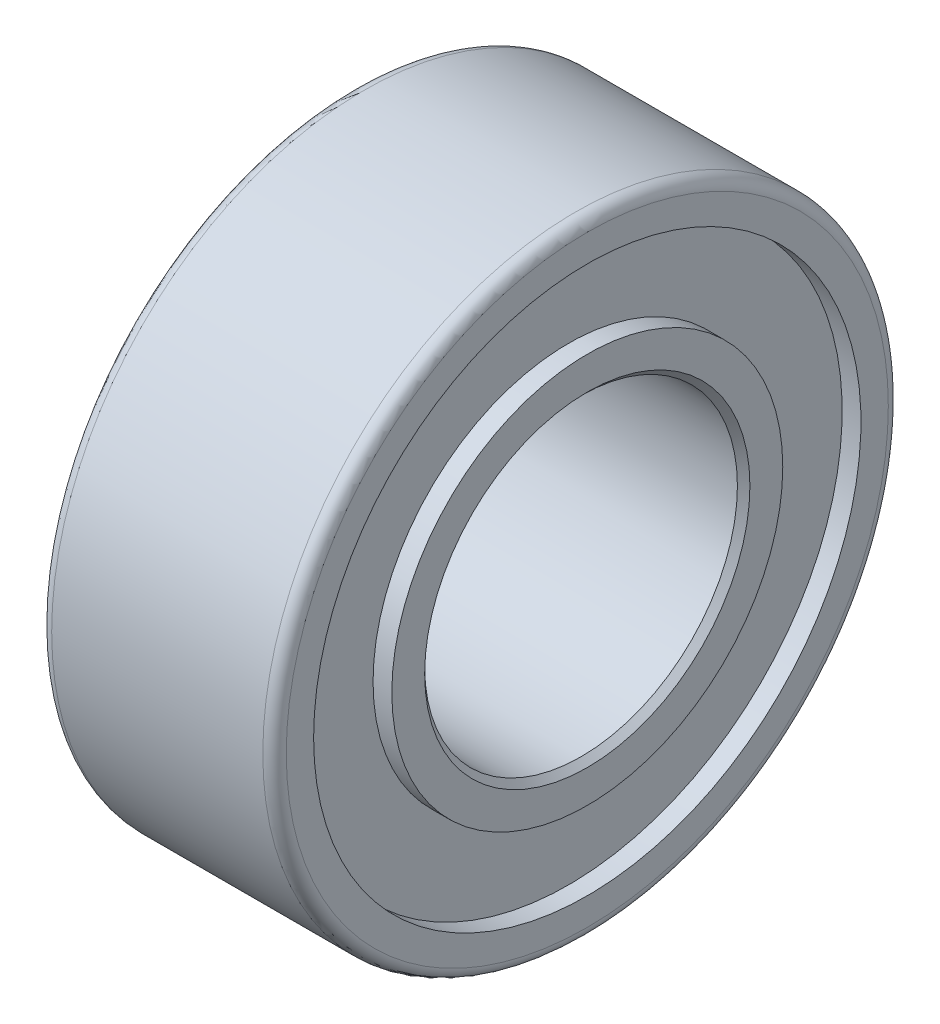
ISO-10303-21;
HEADER;
FILE_DESCRIPTION(('STEP AP214'),'2;1');
FILE_NAME('part.step','',(''),(''),'','','');
FILE_SCHEMA(('AUTOMOTIVE_DESIGN { 1 0 10303 214 1 1 1 1 }'));
ENDSEC;
DATA;
#1=APPLICATION_CONTEXT('core data for automotive mechanical design processes');
#2=APPLICATION_PROTOCOL_DEFINITION('international standard','automotive_design',2000,#1);
#3=PRODUCT_CONTEXT('',#1,'mechanical');
#4=PRODUCT('Part','Part','',(#3));
#5=PRODUCT_RELATED_PRODUCT_CATEGORY('part','',(#4));
#6=PRODUCT_DEFINITION_FORMATION('','',#4);
#7=PRODUCT_DEFINITION_CONTEXT('part definition',#1,'design');
#8=PRODUCT_DEFINITION('design','',#6,#7);
#9=PRODUCT_DEFINITION_SHAPE('','',#8);
#10=(LENGTH_UNIT() NAMED_UNIT(*) SI_UNIT(.MILLI.,.METRE.));
#11=(NAMED_UNIT(*) PLANE_ANGLE_UNIT() SI_UNIT($,.RADIAN.));
#12=(NAMED_UNIT(*) SI_UNIT($,.STERADIAN.) SOLID_ANGLE_UNIT());
#13=UNCERTAINTY_MEASURE_WITH_UNIT(LENGTH_MEASURE(1.E-05),#10,'distance_accuracy_value','');
#14=(GEOMETRIC_REPRESENTATION_CONTEXT(3) GLOBAL_UNCERTAINTY_ASSIGNED_CONTEXT((#13)) GLOBAL_UNIT_ASSIGNED_CONTEXT((#10,
#11,#12)) REPRESENTATION_CONTEXT('',''));
#15=CARTESIAN_POINT('',(0.,0.,0.));
#16=DIRECTION('',(0.,0.,1.));
#17=DIRECTION('',(1.,0.,0.));
#18=AXIS2_PLACEMENT_3D('',#15,#16,#17);
#19=CARTESIAN_POINT('',(0.,0.,0.));
#20=DIRECTION('',(-1.,0.,0.));
#21=DIRECTION('',(0.,0.,1.));
#22=AXIS2_PLACEMENT_3D('',#19,#20,#21);
#23=CYLINDRICAL_SURFACE('',#22,3.175);
#24=CARTESIAN_POINT('',(-2.25424999996449,0.,0.));
#25=DIRECTION('',(-1.,0.,0.));
#26=DIRECTION('',(0.,0.,1.));
#27=AXIS2_PLACEMENT_3D('',#24,#25,#26);
#28=CIRCLE('',#27,3.17499999999882);
#29=CARTESIAN_POINT('',(-2.25424999996449,0.,3.17499999999882));
#30=VERTEX_POINT('',#29);
#31=EDGE_CURVE('E64',#30,#30,#28,.T.);
#32=ORIENTED_EDGE('',*,*,#31,.T.);
#33=EDGE_LOOP('',(#32));
#34=FACE_BOUND('',#33,.T.);
#35=CARTESIAN_POINT('',(2.25425000002133,0.,0.));
#36=DIRECTION('',(1.,0.,0.));
#37=DIRECTION('',(0.,0.,-1.));
#38=AXIS2_PLACEMENT_3D('',#35,#36,#37);
#39=CIRCLE('',#38,3.17500000005566);
#40=CARTESIAN_POINT('',(2.25425000002133,0.,-3.17500000005566));
#41=VERTEX_POINT('',#40);
#42=EDGE_CURVE('E296',#41,#41,#39,.T.);
#43=ORIENTED_EDGE('',*,*,#42,.T.);
#44=EDGE_LOOP('',(#43));
#45=FACE_BOUND('',#44,.T.);
#46=ADVANCED_FACE('F16',(#34,#45),#23,.F.);
#47=CARTESIAN_POINT('',(2.38125000004175,0.,0.));
#48=DIRECTION('',(1.,0.,0.));
#49=DIRECTION('',(0.,0.,-1.));
#50=AXIS2_PLACEMENT_3D('',#47,#48,#49);
#51=CONICAL_SURFACE('',#50,3.30200000001923,0.785398163173655);
#52=CARTESIAN_POINT('',(2.38125000004175,0.,0.));
#53=DIRECTION('',(1.,0.,0.));
#54=DIRECTION('',(0.,0.,-1.));
#55=AXIS2_PLACEMENT_3D('',#52,#53,#54);
#56=CIRCLE('',#55,3.30200000001923);
#57=CARTESIAN_POINT('',(2.38125000004175,0.,-3.30200000001923));
#58=VERTEX_POINT('',#57);
#59=EDGE_CURVE('E318',#58,#58,#56,.T.);
#60=ORIENTED_EDGE('',*,*,#59,.T.);
#61=EDGE_LOOP('',(#60));
#62=FACE_BOUND('',#61,.T.);
#63=ORIENTED_EDGE('',*,*,#42,.F.);
#64=EDGE_LOOP('',(#63));
#65=FACE_BOUND('',#64,.T.);
#66=ADVANCED_FACE('F160',(#62,#65),#51,.F.);
#67=CARTESIAN_POINT('',(-2.38124999992806,0.,0.));
#68=DIRECTION('',(-1.,0.,0.));
#69=DIRECTION('',(0.,0.,1.));
#70=AXIS2_PLACEMENT_3D('',#67,#68,#69);
#71=CONICAL_SURFACE('',#70,3.30199999990555,0.785398163397448);
#72=CARTESIAN_POINT('',(-2.3812499999849,0.,0.));
#73=DIRECTION('',(-1.,0.,0.));
#74=DIRECTION('',(0.,0.,1.));
#75=AXIS2_PLACEMENT_3D('',#72,#73,#74);
#76=CIRCLE('',#75,3.30199999996239);
#77=CARTESIAN_POINT('',(-2.3812499999849,0.,3.30199999996239));
#78=VERTEX_POINT('',#77);
#79=EDGE_CURVE('E315',#78,#78,#76,.T.);
#80=ORIENTED_EDGE('',*,*,#79,.T.);
#81=EDGE_LOOP('',(#80));
#82=FACE_BOUND('',#81,.T.);
#83=ORIENTED_EDGE('',*,*,#31,.F.);
#84=EDGE_LOOP('',(#83));
#85=FACE_BOUND('',#84,.T.);
#86=ADVANCED_FACE('F157',(#82,#85),#71,.F.);
#87=CARTESIAN_POINT('',(2.38125,3.175,0.));
#88=DIRECTION('',(-1.,0.,0.));
#89=DIRECTION('',(0.,0.,1.));
#90=AXIS2_PLACEMENT_3D('',#87,#88,#89);
#91=PLANE('',#90);
#92=CARTESIAN_POINT('',(2.38125,0.,0.));
#93=DIRECTION('',(-1.,0.,0.));
#94=DIRECTION('',(0.,0.,1.));
#95=AXIS2_PLACEMENT_3D('',#92,#93,#94);
#96=CIRCLE('',#95,3.96875);
#97=CARTESIAN_POINT('',(2.38125,0.,3.96875));
#98=VERTEX_POINT('',#97);
#99=EDGE_CURVE('E312',#98,#98,#96,.T.);
#100=ORIENTED_EDGE('',*,*,#99,.F.);
#101=EDGE_LOOP('',(#100));
#102=FACE_BOUND('',#101,.T.);
#103=ORIENTED_EDGE('',*,*,#59,.F.);
#104=EDGE_LOOP('',(#103));
#105=FACE_BOUND('',#104,.T.);
#106=ADVANCED_FACE('F153',(#102,#105),#91,.F.);
#107=CARTESIAN_POINT('',(-2.38125,3.96875,0.));
#108=DIRECTION('',(1.,0.,0.));
#109=DIRECTION('',(0.,0.,-1.));
#110=AXIS2_PLACEMENT_3D('',#107,#108,#109);
#111=PLANE('',#110);
#112=CARTESIAN_POINT('',(-2.38125,0.,0.));
#113=DIRECTION('',(-1.,0.,0.));
#114=DIRECTION('',(0.,0.,1.));
#115=AXIS2_PLACEMENT_3D('',#112,#113,#114);
#116=CIRCLE('',#115,3.96875);
#117=CARTESIAN_POINT('',(-2.38125,0.,3.96875));
#118=VERTEX_POINT('',#117);
#119=EDGE_CURVE('E309',#118,#118,#116,.F.);
#120=ORIENTED_EDGE('',*,*,#119,.F.);
#121=EDGE_LOOP('',(#120));
#122=FACE_BOUND('',#121,.T.);
#123=ORIENTED_EDGE('',*,*,#79,.F.);
#124=EDGE_LOOP('',(#123));
#125=FACE_BOUND('',#124,.T.);
#126=ADVANCED_FACE('F149',(#122,#125),#111,.F.);
#127=CARTESIAN_POINT('',(0.,0.,0.));
#128=DIRECTION('',(-1.,0.,0.));
#129=DIRECTION('',(0.,0.,1.));
#130=AXIS2_PLACEMENT_3D('',#127,#128,#129);
#131=CYLINDRICAL_SURFACE('',#130,3.96875);
#132=CARTESIAN_POINT('',(2.00025,0.,0.));
#133=DIRECTION('',(-1.,0.,0.));
#134=DIRECTION('',(0.,0.,1.));
#135=AXIS2_PLACEMENT_3D('',#132,#133,#134);
#136=CIRCLE('',#135,3.96875);
#137=CARTESIAN_POINT('',(2.00025,0.,3.96875));
#138=VERTEX_POINT('',#137);
#139=EDGE_CURVE('E306',#138,#138,#136,.F.);
#140=ORIENTED_EDGE('',*,*,#139,.T.);
#141=EDGE_LOOP('',(#140));
#142=FACE_BOUND('',#141,.T.);
#143=ORIENTED_EDGE('',*,*,#99,.T.);
#144=EDGE_LOOP('',(#143));
#145=FACE_BOUND('',#144,.T.);
#146=ADVANCED_FACE('F145',(#142,#145),#131,.T.);
#147=CARTESIAN_POINT('',(0.,0.,0.));
#148=DIRECTION('',(-1.,0.,0.));
#149=DIRECTION('',(0.,0.,1.));
#150=AXIS2_PLACEMENT_3D('',#147,#148,#149);
#151=CYLINDRICAL_SURFACE('',#150,3.96875);
#152=ORIENTED_EDGE('',*,*,#119,.T.);
#153=EDGE_LOOP('',(#152));
#154=FACE_BOUND('',#153,.T.);
#155=CARTESIAN_POINT('',(-2.00025,0.,0.));
#156=DIRECTION('',(-1.,0.,0.));
#157=DIRECTION('',(0.,0.,1.));
#158=AXIS2_PLACEMENT_3D('',#155,#156,#157);
#159=CIRCLE('',#158,3.96875);
#160=CARTESIAN_POINT('',(-2.00025,0.,3.96875));
#161=VERTEX_POINT('',#160);
#162=EDGE_CURVE('E303',#161,#161,#159,.T.);
#163=ORIENTED_EDGE('',*,*,#162,.T.);
#164=EDGE_LOOP('',(#163));
#165=FACE_BOUND('',#164,.T.);
#166=ADVANCED_FACE('F141',(#154,#165),#151,.T.);
#167=CARTESIAN_POINT('',(2.00025,3.96875,0.));
#168=DIRECTION('',(-1.,0.,0.));
#169=DIRECTION('',(0.,0.,1.));
#170=AXIS2_PLACEMENT_3D('',#167,#168,#169);
#171=PLANE('',#170);
#172=ORIENTED_EDGE('',*,*,#139,.F.);
#173=EDGE_LOOP('',(#172));
#174=FACE_BOUND('',#173,.T.);
#175=CARTESIAN_POINT('',(2.00025,0.,0.));
#176=DIRECTION('',(-1.,0.,0.));
#177=DIRECTION('',(0.,0.,1.));
#178=AXIS2_PLACEMENT_3D('',#175,#176,#177);
#179=CIRCLE('',#178,5.55625);
#180=CARTESIAN_POINT('',(2.00025,0.,5.55625));
#181=VERTEX_POINT('',#180);
#182=EDGE_CURVE('E300',#181,#181,#179,.F.);
#183=ORIENTED_EDGE('',*,*,#182,.T.);
#184=EDGE_LOOP('',(#183));
#185=FACE_BOUND('',#184,.T.);
#186=ADVANCED_FACE('F137',(#174,#185),#171,.F.);
#187=CARTESIAN_POINT('',(-2.00025,5.55625,0.));
#188=DIRECTION('',(1.,0.,0.));
#189=DIRECTION('',(0.,0.,-1.));
#190=AXIS2_PLACEMENT_3D('',#187,#188,#189);
#191=PLANE('',#190);
#192=CARTESIAN_POINT('',(-2.00025,0.,0.));
#193=DIRECTION('',(-1.,0.,0.));
#194=DIRECTION('',(0.,0.,1.));
#195=AXIS2_PLACEMENT_3D('',#192,#193,#194);
#196=CIRCLE('',#195,5.55625);
#197=CARTESIAN_POINT('',(-2.00025,0.,5.55625));
#198=VERTEX_POINT('',#197);
#199=EDGE_CURVE('E294',#198,#198,#196,.T.);
#200=ORIENTED_EDGE('',*,*,#199,.T.);
#201=EDGE_LOOP('',(#200));
#202=FACE_BOUND('',#201,.T.);
#203=ORIENTED_EDGE('',*,*,#162,.F.);
#204=EDGE_LOOP('',(#203));
#205=FACE_BOUND('',#204,.T.);
#206=ADVANCED_FACE('F133',(#202,#205),#191,.F.);
#207=CARTESIAN_POINT('',(0.,0.,0.));
#208=DIRECTION('',(-1.,0.,0.));
#209=DIRECTION('',(0.,0.,1.));
#210=AXIS2_PLACEMENT_3D('',#207,#208,#209);
#211=CYLINDRICAL_SURFACE('',#210,5.55625);
#212=CARTESIAN_POINT('',(2.38125,0.,0.));
#213=DIRECTION('',(-1.,0.,0.));
#214=DIRECTION('',(0.,0.,1.));
#215=AXIS2_PLACEMENT_3D('',#212,#213,#214);
#216=CIRCLE('',#215,5.55625);
#217=CARTESIAN_POINT('',(2.38125,0.,5.55625));
#218=VERTEX_POINT('',#217);
#219=EDGE_CURVE('E291',#218,#218,#216,.F.);
#220=ORIENTED_EDGE('',*,*,#219,.T.);
#221=EDGE_LOOP('',(#220));
#222=FACE_BOUND('',#221,.T.);
#223=ORIENTED_EDGE('',*,*,#182,.F.);
#224=EDGE_LOOP('',(#223));
#225=FACE_BOUND('',#224,.T.);
#226=ADVANCED_FACE('F129',(#222,#225),#211,.F.);
#227=CARTESIAN_POINT('',(0.,0.,0.));
#228=DIRECTION('',(-1.,0.,0.));
#229=DIRECTION('',(0.,0.,1.));
#230=AXIS2_PLACEMENT_3D('',#227,#228,#229);
#231=CYLINDRICAL_SURFACE('',#230,5.55625);
#232=ORIENTED_EDGE('',*,*,#199,.F.);
#233=EDGE_LOOP('',(#232));
#234=FACE_BOUND('',#233,.T.);
#235=CARTESIAN_POINT('',(-2.38125,0.,0.));
#236=DIRECTION('',(-1.,0.,0.));
#237=DIRECTION('',(0.,0.,1.));
#238=AXIS2_PLACEMENT_3D('',#235,#236,#237);
#239=CIRCLE('',#238,5.55625);
#240=CARTESIAN_POINT('',(-2.38125,0.,5.55625));
#241=VERTEX_POINT('',#240);
#242=EDGE_CURVE('E51',#241,#241,#239,.T.);
#243=ORIENTED_EDGE('',*,*,#242,.T.);
#244=EDGE_LOOP('',(#243));
#245=FACE_BOUND('',#244,.T.);
#246=ADVANCED_FACE('F124',(#234,#245),#231,.F.);
#247=CARTESIAN_POINT('',(2.38125,5.55625,0.));
#248=DIRECTION('',(-1.,0.,0.));
#249=DIRECTION('',(0.,0.,1.));
#250=AXIS2_PLACEMENT_3D('',#247,#248,#249);
#251=PLANE('',#250);
#252=ORIENTED_EDGE('',*,*,#219,.F.);
#253=EDGE_LOOP('',(#252));
#254=FACE_BOUND('',#253,.T.);
#255=CARTESIAN_POINT('',(2.38125,0.,0.));
#256=DIRECTION('',(-1.,0.,0.));
#257=DIRECTION('',(0.,0.,1.));
#258=AXIS2_PLACEMENT_3D('',#255,#256,#257);
#259=CIRCLE('',#258,6.111875);
#260=CARTESIAN_POINT('',(2.38125,0.,6.111875));
#261=VERTEX_POINT('',#260);
#262=CARTESIAN_POINT('',(2.38125,0.,-6.111875));
#263=VERTEX_POINT('',#262);
#264=EDGE_CURVE('E44',#261,#263,#259,.T.);
#265=ORIENTED_EDGE('',*,*,#264,.F.);
#266=CARTESIAN_POINT('',(2.38125,0.,0.));
#267=DIRECTION('',(-1.,0.,0.));
#268=DIRECTION('',(0.,0.,-1.));
#269=AXIS2_PLACEMENT_3D('',#266,#267,#268);
#270=CIRCLE('',#269,6.111875);
#271=EDGE_CURVE('E47',#263,#261,#270,.T.);
#272=ORIENTED_EDGE('',*,*,#271,.F.);
#273=EDGE_LOOP('',(#265,#272));
#274=FACE_BOUND('',#273,.T.);
#275=ADVANCED_FACE('F49',(#254,#274),#251,.F.);
#276=CARTESIAN_POINT('',(-2.38125,6.35,0.));
#277=DIRECTION('',(1.,0.,0.));
#278=DIRECTION('',(0.,0.,-1.));
#279=AXIS2_PLACEMENT_3D('',#276,#277,#278);
#280=PLANE('',#279);
#281=ORIENTED_EDGE('',*,*,#242,.F.);
#282=EDGE_LOOP('',(#281));
#283=FACE_BOUND('',#282,.T.);
#284=CARTESIAN_POINT('',(-2.38125,0.,0.));
#285=DIRECTION('',(1.,0.,0.));
#286=DIRECTION('',(0.,0.,-1.));
#287=AXIS2_PLACEMENT_3D('',#284,#285,#286);
#288=CIRCLE('',#287,6.111875);
#289=CARTESIAN_POINT('',(-2.38125,0.,-6.111875));
#290=VERTEX_POINT('',#289);
#291=CARTESIAN_POINT('',(-2.38125,0.,6.111875));
#292=VERTEX_POINT('',#291);
#293=EDGE_CURVE('E56',#290,#292,#288,.T.);
#294=ORIENTED_EDGE('',*,*,#293,.F.);
#295=CARTESIAN_POINT('',(-2.38125,0.,0.));
#296=DIRECTION('',(1.,0.,0.));
#297=DIRECTION('',(0.,0.,1.));
#298=AXIS2_PLACEMENT_3D('',#295,#296,#297);
#299=CIRCLE('',#298,6.111875);
#300=EDGE_CURVE('E35',#292,#290,#299,.T.);
#301=ORIENTED_EDGE('',*,*,#300,.F.);
#302=EDGE_LOOP('',(#294,#301));
#303=FACE_BOUND('',#302,.T.);
#304=ADVANCED_FACE('F77',(#283,#303),#280,.F.);
#305=CARTESIAN_POINT('',(2.143125,0.,0.));
#306=DIRECTION('',(-1.,0.,0.));
#307=DIRECTION('',(0.,0.,1.));
#308=AXIS2_PLACEMENT_3D('',#305,#306,#307);
#309=TOROIDAL_SURFACE('',#308,6.111875,0.238125);
#310=CARTESIAN_POINT('',(2.143125,0.,0.));
#311=DIRECTION('',(-1.,0.,0.));
#312=DIRECTION('',(0.,0.,1.));
#313=AXIS2_PLACEMENT_3D('',#310,#311,#312);
#314=CIRCLE('',#313,6.35);
#315=CARTESIAN_POINT('',(2.143125,0.,6.35));
#316=VERTEX_POINT('',#315);
#317=EDGE_CURVE('E27',#316,#316,#314,.T.);
#318=ORIENTED_EDGE('',*,*,#317,.F.);
#319=EDGE_LOOP('',(#318));
#320=FACE_BOUND('',#319,.T.);
#321=ORIENTED_EDGE('',*,*,#264,.T.);
#322=ORIENTED_EDGE('',*,*,#271,.T.);
#323=EDGE_LOOP('',(#321,#322));
#324=FACE_BOUND('',#323,.T.);
#325=ADVANCED_FACE('F55',(#320,#324),#309,.T.);
#326=CARTESIAN_POINT('',(-2.143125,0.,0.));
#327=DIRECTION('',(1.,0.,0.));
#328=DIRECTION('',(0.,0.,-1.));
#329=AXIS2_PLACEMENT_3D('',#326,#327,#328);
#330=TOROIDAL_SURFACE('',#329,6.111875,0.238125);
#331=CARTESIAN_POINT('',(-2.143125,0.,0.));
#332=DIRECTION('',(-1.,0.,0.));
#333=DIRECTION('',(0.,0.,1.));
#334=AXIS2_PLACEMENT_3D('',#331,#332,#333);
#335=CIRCLE('',#334,6.35);
#336=CARTESIAN_POINT('',(-2.143125,0.,6.35));
#337=VERTEX_POINT('',#336);
#338=EDGE_CURVE('E11',#337,#337,#335,.F.);
#339=ORIENTED_EDGE('',*,*,#338,.F.);
#340=EDGE_LOOP('',(#339));
#341=FACE_BOUND('',#340,.T.);
#342=ORIENTED_EDGE('',*,*,#293,.T.);
#343=ORIENTED_EDGE('',*,*,#300,.T.);
#344=EDGE_LOOP('',(#342,#343));
#345=FACE_BOUND('',#344,.T.);
#346=ADVANCED_FACE('F76',(#341,#345),#330,.T.);
#347=CARTESIAN_POINT('',(0.,0.,0.));
#348=DIRECTION('',(-1.,0.,0.));
#349=DIRECTION('',(0.,0.,1.));
#350=AXIS2_PLACEMENT_3D('',#347,#348,#349);
#351=CYLINDRICAL_SURFACE('',#350,6.35);
#352=ORIENTED_EDGE('',*,*,#338,.T.);
#353=EDGE_LOOP('',(#352));
#354=FACE_BOUND('',#353,.T.);
#355=ORIENTED_EDGE('',*,*,#317,.T.);
#356=EDGE_LOOP('',(#355));
#357=FACE_BOUND('',#356,.T.);
#358=ADVANCED_FACE('F171',(#354,#357),#351,.T.);
#359=CLOSED_SHELL('',(#46,#66,#86,#106,#126,#146,#166,#186,#206,#226,#246,#275,#304,#325,#346,#358));
#360=MANIFOLD_SOLID_BREP('B1',#359);
#361=ADVANCED_BREP_SHAPE_REPRESENTATION('',(#18,#360),#14);
#362=SHAPE_DEFINITION_REPRESENTATION(#9,#361);
ENDSEC;
END-ISO-10303-21;
